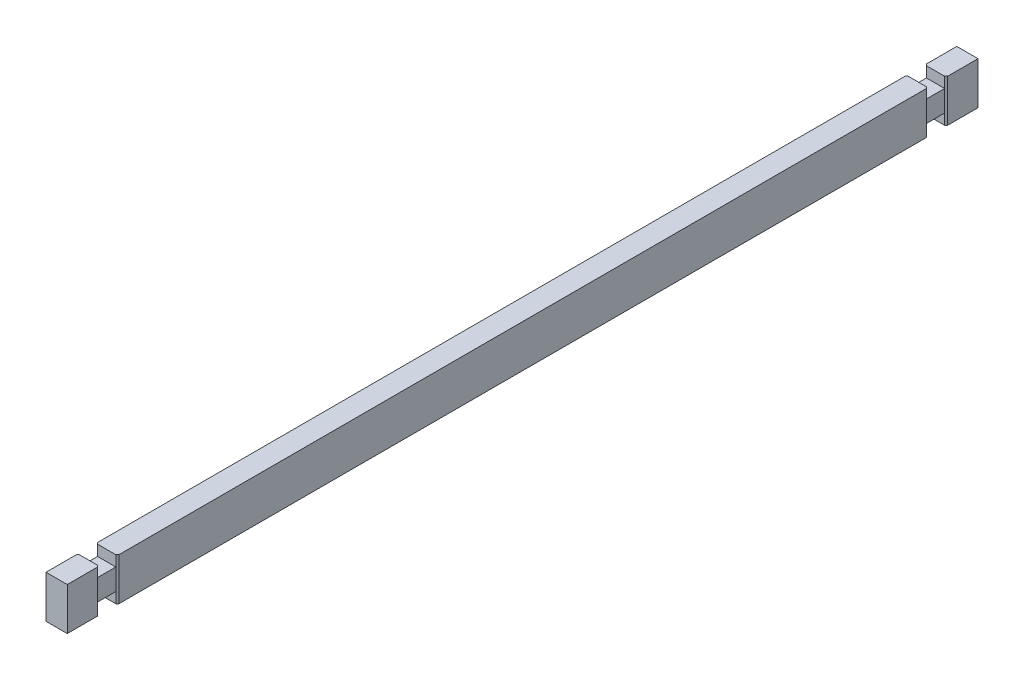
ISO-10303-21;
HEADER;
FILE_DESCRIPTION(('STEP AP214'),'2;1');
FILE_NAME('part.step','',(''),(''),'','','');
FILE_SCHEMA(('AUTOMOTIVE_DESIGN { 1 0 10303 214 1 1 1 1 }'));
ENDSEC;
DATA;
#1=APPLICATION_CONTEXT('core data for automotive mechanical design processes');
#2=APPLICATION_PROTOCOL_DEFINITION('international standard','automotive_design',2000,#1);
#3=PRODUCT_CONTEXT('',#1,'mechanical');
#4=PRODUCT('Part','Part','',(#3));
#5=PRODUCT_RELATED_PRODUCT_CATEGORY('part','',(#4));
#6=PRODUCT_DEFINITION_FORMATION('','',#4);
#7=PRODUCT_DEFINITION_CONTEXT('part definition',#1,'design');
#8=PRODUCT_DEFINITION('design','',#6,#7);
#9=PRODUCT_DEFINITION_SHAPE('','',#8);
#10=(LENGTH_UNIT() NAMED_UNIT(*) SI_UNIT(.MILLI.,.METRE.));
#11=(NAMED_UNIT(*) PLANE_ANGLE_UNIT() SI_UNIT($,.RADIAN.));
#12=(NAMED_UNIT(*) SI_UNIT($,.STERADIAN.) SOLID_ANGLE_UNIT());
#13=UNCERTAINTY_MEASURE_WITH_UNIT(LENGTH_MEASURE(1.E-05),#10,'distance_accuracy_value','');
#14=(GEOMETRIC_REPRESENTATION_CONTEXT(3) GLOBAL_UNCERTAINTY_ASSIGNED_CONTEXT((#13)) GLOBAL_UNIT_ASSIGNED_CONTEXT((#10,
#11,#12)) REPRESENTATION_CONTEXT('',''));
#15=CARTESIAN_POINT('',(0.,0.,0.));
#16=DIRECTION('',(0.,0.,1.));
#17=DIRECTION('',(1.,0.,0.));
#18=AXIS2_PLACEMENT_3D('',#15,#16,#17);
#19=CARTESIAN_POINT('',(-35.,-70.,3000.));
#20=DIRECTION('',(0.,1.,0.));
#21=DIRECTION('',(0.,0.,1.));
#22=AXIS2_PLACEMENT_3D('',#19,#20,#21);
#23=PLANE('',#22);
#24=DIRECTION('',(0.707106916720686,0.,-0.707106645652383));
#25=VECTOR('',#24,1.);
#26=CARTESIAN_POINT('',(-30.,-70.,2895.00000191674));
#27=LINE('',#26,#25);
#28=CARTESIAN_POINT('',(-35.,-70.,2900.));
#29=VERTEX_POINT('',#28);
#30=CARTESIAN_POINT('',(-30.,-70.,2895.00000191674));
#31=VERTEX_POINT('',#30);
#32=EDGE_CURVE('E48',#29,#31,#27,.T.);
#33=ORIENTED_EDGE('',*,*,#32,.T.);
#34=DIRECTION('',(1.,0.,0.));
#35=VECTOR('',#34,1.);
#36=CARTESIAN_POINT('',(-35.,-70.,2894.99999808326));
#37=LINE('',#36,#35);
#38=CARTESIAN_POINT('',(30.0000000000008,-70.,2894.99999808326));
#39=VERTEX_POINT('',#38);
#40=EDGE_CURVE('E215',#31,#39,#37,.T.);
#41=ORIENTED_EDGE('',*,*,#40,.T.);
#42=DIRECTION('',(0.707106645652409,0.,0.70710691672066));
#43=VECTOR('',#42,1.);
#44=CARTESIAN_POINT('',(35.,-70.,2900.));
#45=LINE('',#44,#43);
#46=CARTESIAN_POINT('',(35.,-70.,2900.));
#47=VERTEX_POINT('',#46);
#48=EDGE_CURVE('E227',#39,#47,#45,.T.);
#49=ORIENTED_EDGE('',*,*,#48,.T.);
#50=DIRECTION('',(0.,0.,-1.));
#51=VECTOR('',#50,1.);
#52=CARTESIAN_POINT('',(35.,-70.,3000.));
#53=LINE('',#52,#51);
#54=CARTESIAN_POINT('',(35.,-70.,3000.));
#55=VERTEX_POINT('',#54);
#56=EDGE_CURVE('E373',#55,#47,#53,.T.);
#57=ORIENTED_EDGE('',*,*,#56,.F.);
#58=DIRECTION('',(1.,0.,0.));
#59=VECTOR('',#58,1.);
#60=CARTESIAN_POINT('',(-35.,-70.,3000.));
#61=LINE('',#60,#59);
#62=CARTESIAN_POINT('',(-35.,-70.,3000.));
#63=VERTEX_POINT('',#62);
#64=EDGE_CURVE('E356',#63,#55,#61,.T.);
#65=ORIENTED_EDGE('',*,*,#64,.F.);
#66=DIRECTION('',(0.,0.,-1.));
#67=VECTOR('',#66,1.);
#68=CARTESIAN_POINT('',(-35.,-70.,3000.));
#69=LINE('',#68,#67);
#70=EDGE_CURVE('E377',#63,#29,#69,.T.);
#71=ORIENTED_EDGE('',*,*,#70,.T.);
#72=EDGE_LOOP('',(#33,#41,#49,#57,#65,#71));
#73=FACE_BOUND('',#72,.T.);
#74=ADVANCED_FACE('F26',(#73),#23,.F.);
#75=CARTESIAN_POINT('',(-35.,70.,3000.));
#76=DIRECTION('',(0.,-1.,0.));
#77=DIRECTION('',(0.,0.,-1.));
#78=AXIS2_PLACEMENT_3D('',#75,#76,#77);
#79=PLANE('',#78);
#80=DIRECTION('',(0.707106645652409,0.,0.70710691672066));
#81=VECTOR('',#80,1.);
#82=CARTESIAN_POINT('',(35.,70.,2900.));
#83=LINE('',#82,#81);
#84=CARTESIAN_POINT('',(30.0000000000008,70.,2894.99999808326));
#85=VERTEX_POINT('',#84);
#86=CARTESIAN_POINT('',(35.,70.,2900.));
#87=VERTEX_POINT('',#86);
#88=EDGE_CURVE('E241',#85,#87,#83,.T.);
#89=ORIENTED_EDGE('',*,*,#88,.F.);
#90=DIRECTION('',(1.,0.,0.));
#91=VECTOR('',#90,1.);
#92=CARTESIAN_POINT('',(-35.,70.,2894.99999808326));
#93=LINE('',#92,#91);
#94=CARTESIAN_POINT('',(-29.9999961665143,70.,2894.99999808326));
#95=VERTEX_POINT('',#94);
#96=EDGE_CURVE('E430',#95,#85,#93,.T.);
#97=ORIENTED_EDGE('',*,*,#96,.F.);
#98=DIRECTION('',(0.707106916720686,0.,-0.707106645652383));
#99=VECTOR('',#98,1.);
#100=CARTESIAN_POINT('',(-30.,70.,2895.00000191674));
#101=LINE('',#100,#99);
#102=CARTESIAN_POINT('',(-35.,70.,2900.));
#103=VERTEX_POINT('',#102);
#104=EDGE_CURVE('E398',#103,#95,#101,.T.);
#105=ORIENTED_EDGE('',*,*,#104,.F.);
#106=DIRECTION('',(0.,0.,-1.));
#107=VECTOR('',#106,1.);
#108=CARTESIAN_POINT('',(-35.,70.,3000.));
#109=LINE('',#108,#107);
#110=CARTESIAN_POINT('',(-35.,70.,3000.));
#111=VERTEX_POINT('',#110);
#112=EDGE_CURVE('E363',#111,#103,#109,.T.);
#113=ORIENTED_EDGE('',*,*,#112,.F.);
#114=DIRECTION('',(-1.,0.,0.));
#115=VECTOR('',#114,1.);
#116=CARTESIAN_POINT('',(-35.,70.,3000.));
#117=LINE('',#116,#115);
#118=CARTESIAN_POINT('',(35.,70.,3000.));
#119=VERTEX_POINT('',#118);
#120=EDGE_CURVE('E360',#119,#111,#117,.T.);
#121=ORIENTED_EDGE('',*,*,#120,.F.);
#122=DIRECTION('',(0.,0.,-1.));
#123=VECTOR('',#122,1.);
#124=CARTESIAN_POINT('',(35.,70.,3000.));
#125=LINE('',#124,#123);
#126=EDGE_CURVE('E368',#119,#87,#125,.T.);
#127=ORIENTED_EDGE('',*,*,#126,.T.);
#128=EDGE_LOOP('',(#89,#97,#105,#113,#121,#127));
#129=FACE_BOUND('',#128,.T.);
#130=ADVANCED_FACE('F459',(#129),#79,.F.);
#131=CARTESIAN_POINT('',(-35.,70.,3000.));
#132=DIRECTION('',(1.,0.,0.));
#133=DIRECTION('',(0.,1.,0.));
#134=AXIS2_PLACEMENT_3D('',#131,#132,#133);
#135=PLANE('',#134);
#136=CARTESIAN_POINT('',(-35.,-70.,2830.));
#137=VERTEX_POINT('',#136);
#138=CARTESIAN_POINT('',(-35.,-70.,170.));
#139=VERTEX_POINT('',#138);
#140=EDGE_CURVE('E378',#137,#139,#69,.T.);
#141=ORIENTED_EDGE('',*,*,#140,.F.);
#142=DIRECTION('',(0.,1.,0.));
#143=VECTOR('',#142,1.);
#144=CARTESIAN_POINT('',(-35.,-70.,2830.));
#145=LINE('',#144,#143);
#146=CARTESIAN_POINT('',(-35.,70.,2830.));
#147=VERTEX_POINT('',#146);
#148=EDGE_CURVE('E414',#137,#147,#145,.T.);
#149=ORIENTED_EDGE('',*,*,#148,.T.);
#150=CARTESIAN_POINT('',(-35.,70.,170.));
#151=VERTEX_POINT('',#150);
#152=EDGE_CURVE('E367',#147,#151,#109,.T.);
#153=ORIENTED_EDGE('',*,*,#152,.T.);
#154=DIRECTION('',(0.,1.,0.));
#155=VECTOR('',#154,1.);
#156=CARTESIAN_POINT('',(-35.,-70.,170.));
#157=LINE('',#156,#155);
#158=EDGE_CURVE('E328',#139,#151,#157,.T.);
#159=ORIENTED_EDGE('',*,*,#158,.F.);
#160=EDGE_LOOP('',(#141,#149,#153,#159));
#161=FACE_BOUND('',#160,.T.);
#162=ADVANCED_FACE('F474',(#161),#135,.F.);
#163=CARTESIAN_POINT('',(35.,70.,3000.));
#164=DIRECTION('',(-1.,0.,0.));
#165=DIRECTION('',(0.,-1.,0.));
#166=AXIS2_PLACEMENT_3D('',#163,#164,#165);
#167=PLANE('',#166);
#168=CARTESIAN_POINT('',(35.,70.,2830.));
#169=VERTEX_POINT('',#168);
#170=CARTESIAN_POINT('',(35.,70.,170.));
#171=VERTEX_POINT('',#170);
#172=EDGE_CURVE('E372',#169,#171,#125,.T.);
#173=ORIENTED_EDGE('',*,*,#172,.F.);
#174=DIRECTION('',(0.,1.,0.));
#175=VECTOR('',#174,1.);
#176=CARTESIAN_POINT('',(35.,-70.,2830.));
#177=LINE('',#176,#175);
#178=CARTESIAN_POINT('',(35.,-70.,2830.));
#179=VERTEX_POINT('',#178);
#180=EDGE_CURVE('E245',#179,#169,#177,.T.);
#181=ORIENTED_EDGE('',*,*,#180,.F.);
#182=CARTESIAN_POINT('',(35.,-70.,170.));
#183=VERTEX_POINT('',#182);
#184=EDGE_CURVE('E376',#179,#183,#53,.T.);
#185=ORIENTED_EDGE('',*,*,#184,.T.);
#186=DIRECTION('',(0.,1.,0.));
#187=VECTOR('',#186,1.);
#188=CARTESIAN_POINT('',(35.,-70.,170.));
#189=LINE('',#188,#187);
#190=EDGE_CURVE('E305',#183,#171,#189,.T.);
#191=ORIENTED_EDGE('',*,*,#190,.T.);
#192=EDGE_LOOP('',(#173,#181,#185,#191));
#193=FACE_BOUND('',#192,.T.);
#194=ADVANCED_FACE('F486',(#193),#167,.F.);
#195=DIRECTION('',(-0.707106916720707,0.,0.707106645652362));
#196=VECTOR('',#195,1.);
#197=CARTESIAN_POINT('',(30.0000000000001,-70.,2834.99999808326));
#198=LINE('',#197,#196);
#199=CARTESIAN_POINT('',(30.0000000000008,-70.,2834.99999808326));
#200=VERTEX_POINT('',#199);
#201=EDGE_CURVE('E236',#179,#200,#198,.T.);
#202=ORIENTED_EDGE('',*,*,#201,.T.);
#203=DIRECTION('',(1.,0.,0.));
#204=VECTOR('',#203,1.);
#205=CARTESIAN_POINT('',(-35.,-70.,2834.99999808326));
#206=LINE('',#205,#204);
#207=CARTESIAN_POINT('',(-30.,-70.,2834.99999808326));
#208=VERTEX_POINT('',#207);
#209=EDGE_CURVE('E230',#208,#200,#206,.T.);
#210=ORIENTED_EDGE('',*,*,#209,.F.);
#211=DIRECTION('',(-0.70710664565245,0.,-0.707106916720619));
#212=VECTOR('',#211,1.);
#213=CARTESIAN_POINT('',(-35.,-70.,2830.));
#214=LINE('',#213,#212);
#215=EDGE_CURVE('E404',#208,#137,#214,.T.);
#216=ORIENTED_EDGE('',*,*,#215,.T.);
#217=ORIENTED_EDGE('',*,*,#140,.T.);
#218=DIRECTION('',(0.707106781186543,0.,-0.707106781186552));
#219=VECTOR('',#218,1.);
#220=CARTESIAN_POINT('',(-30.,-70.,165.));
#221=LINE('',#220,#219);
#222=CARTESIAN_POINT('',(-30.,-70.,165.));
#223=VERTEX_POINT('',#222);
#224=EDGE_CURVE('E322',#139,#223,#221,.T.);
#225=ORIENTED_EDGE('',*,*,#224,.T.);
#226=DIRECTION('',(1.,0.,0.));
#227=VECTOR('',#226,1.);
#228=CARTESIAN_POINT('',(-35.,-70.,165.));
#229=LINE('',#228,#227);
#230=CARTESIAN_POINT('',(30.,-70.,165.));
#231=VERTEX_POINT('',#230);
#232=EDGE_CURVE('E252',#223,#231,#229,.T.);
#233=ORIENTED_EDGE('',*,*,#232,.T.);
#234=DIRECTION('',(0.707106781186545,0.,0.70710678118655));
#235=VECTOR('',#234,1.);
#236=CARTESIAN_POINT('',(30.,-70.,165.));
#237=LINE('',#236,#235);
#238=EDGE_CURVE('E301',#231,#183,#237,.T.);
#239=ORIENTED_EDGE('',*,*,#238,.T.);
#240=ORIENTED_EDGE('',*,*,#184,.F.);
#241=EDGE_LOOP('',(#202,#210,#216,#217,#225,#233,#239,#240));
#242=FACE_BOUND('',#241,.T.);
#243=ADVANCED_FACE('F482',(#242),#23,.F.);
#244=DIRECTION('',(-0.70710664565245,0.,-0.707106916720619));
#245=VECTOR('',#244,1.);
#246=CARTESIAN_POINT('',(-35.,70.,2830.));
#247=LINE('',#246,#245);
#248=CARTESIAN_POINT('',(-30.,70.,2834.99999808326));
#249=VERTEX_POINT('',#248);
#250=EDGE_CURVE('E427',#249,#147,#247,.T.);
#251=ORIENTED_EDGE('',*,*,#250,.F.);
#252=DIRECTION('',(1.,0.,0.));
#253=VECTOR('',#252,1.);
#254=CARTESIAN_POINT('',(-35.,70.,2834.99999808326));
#255=LINE('',#254,#253);
#256=CARTESIAN_POINT('',(30.0000000000008,70.,2834.99999808326));
#257=VERTEX_POINT('',#256);
#258=EDGE_CURVE('E434',#249,#257,#255,.T.);
#259=ORIENTED_EDGE('',*,*,#258,.T.);
#260=DIRECTION('',(-0.707106916720707,0.,0.707106645652362));
#261=VECTOR('',#260,1.);
#262=CARTESIAN_POINT('',(30.0000000000001,70.,2834.99999808326));
#263=LINE('',#262,#261);
#264=EDGE_CURVE('E417',#169,#257,#263,.T.);
#265=ORIENTED_EDGE('',*,*,#264,.F.);
#266=ORIENTED_EDGE('',*,*,#172,.T.);
#267=DIRECTION('',(0.707106781186545,0.,0.70710678118655));
#268=VECTOR('',#267,1.);
#269=CARTESIAN_POINT('',(30.,70.,165.));
#270=LINE('',#269,#268);
#271=CARTESIAN_POINT('',(30.,70.,165.));
#272=VERTEX_POINT('',#271);
#273=EDGE_CURVE('E295',#272,#171,#270,.T.);
#274=ORIENTED_EDGE('',*,*,#273,.F.);
#275=DIRECTION('',(1.,0.,0.));
#276=VECTOR('',#275,1.);
#277=CARTESIAN_POINT('',(-35.,70.,165.));
#278=LINE('',#277,#276);
#279=CARTESIAN_POINT('',(-30.,70.,165.));
#280=VERTEX_POINT('',#279);
#281=EDGE_CURVE('E273',#280,#272,#278,.T.);
#282=ORIENTED_EDGE('',*,*,#281,.F.);
#283=DIRECTION('',(0.707106781186543,0.,-0.707106781186552));
#284=VECTOR('',#283,1.);
#285=CARTESIAN_POINT('',(-30.,70.,165.));
#286=LINE('',#285,#284);
#287=EDGE_CURVE('E308',#151,#280,#286,.T.);
#288=ORIENTED_EDGE('',*,*,#287,.F.);
#289=ORIENTED_EDGE('',*,*,#152,.F.);
#290=EDGE_LOOP('',(#251,#259,#265,#266,#274,#282,#288,#289));
#291=FACE_BOUND('',#290,.T.);
#292=ADVANCED_FACE('F491',(#291),#79,.F.);
#293=ORIENTED_EDGE('',*,*,#56,.T.);
#294=DIRECTION('',(0.,1.,0.));
#295=VECTOR('',#294,1.);
#296=CARTESIAN_POINT('',(35.,-70.,2900.));
#297=LINE('',#296,#295);
#298=EDGE_CURVE('E221',#47,#87,#297,.T.);
#299=ORIENTED_EDGE('',*,*,#298,.T.);
#300=ORIENTED_EDGE('',*,*,#126,.F.);
#301=DIRECTION('',(0.,1.,0.));
#302=VECTOR('',#301,1.);
#303=CARTESIAN_POINT('',(35.,70.,3000.));
#304=LINE('',#303,#302);
#305=EDGE_CURVE('E358',#55,#119,#304,.T.);
#306=ORIENTED_EDGE('',*,*,#305,.F.);
#307=EDGE_LOOP('',(#293,#299,#300,#306));
#308=FACE_BOUND('',#307,.T.);
#309=ADVANCED_FACE('F465',(#308),#167,.F.);
#310=CARTESIAN_POINT('',(-35.,-70.,100.));
#311=VERTEX_POINT('',#310);
#312=CARTESIAN_POINT('',(-35.,-70.,0.));
#313=VERTEX_POINT('',#312);
#314=EDGE_CURVE('E375',#311,#313,#69,.T.);
#315=ORIENTED_EDGE('',*,*,#314,.F.);
#316=DIRECTION('',(0.,1.,0.));
#317=VECTOR('',#316,1.);
#318=CARTESIAN_POINT('',(-35.,-70.,100.));
#319=LINE('',#318,#317);
#320=CARTESIAN_POINT('',(-35.,70.,100.));
#321=VERTEX_POINT('',#320);
#322=EDGE_CURVE('E329',#311,#321,#319,.T.);
#323=ORIENTED_EDGE('',*,*,#322,.T.);
#324=CARTESIAN_POINT('',(-35.,70.,0.));
#325=VERTEX_POINT('',#324);
#326=EDGE_CURVE('E362',#321,#325,#109,.T.);
#327=ORIENTED_EDGE('',*,*,#326,.T.);
#328=DIRECTION('',(0.,-1.,0.));
#329=VECTOR('',#328,1.);
#330=CARTESIAN_POINT('',(-35.,70.,0.));
#331=LINE('',#330,#329);
#332=EDGE_CURVE('E332',#325,#313,#331,.T.);
#333=ORIENTED_EDGE('',*,*,#332,.T.);
#334=EDGE_LOOP('',(#315,#323,#327,#333));
#335=FACE_BOUND('',#334,.T.);
#336=ADVANCED_FACE('F473',(#335),#135,.F.);
#337=ORIENTED_EDGE('',*,*,#112,.T.);
#338=DIRECTION('',(0.,1.,0.));
#339=VECTOR('',#338,1.);
#340=CARTESIAN_POINT('',(-35.,-70.,2900.));
#341=LINE('',#340,#339);
#342=EDGE_CURVE('E401',#29,#103,#341,.T.);
#343=ORIENTED_EDGE('',*,*,#342,.F.);
#344=ORIENTED_EDGE('',*,*,#70,.F.);
#345=DIRECTION('',(0.,-1.,0.));
#346=VECTOR('',#345,1.);
#347=CARTESIAN_POINT('',(-35.,70.,3000.));
#348=LINE('',#347,#346);
#349=EDGE_CURVE('E353',#111,#63,#348,.T.);
#350=ORIENTED_EDGE('',*,*,#349,.F.);
#351=EDGE_LOOP('',(#337,#343,#344,#350));
#352=FACE_BOUND('',#351,.T.);
#353=ADVANCED_FACE('F28',(#352),#135,.F.);
#354=DIRECTION('',(-0.70710678118655,0.,0.707106781186545));
#355=VECTOR('',#354,1.);
#356=CARTESIAN_POINT('',(35.,-70.,100.));
#357=LINE('',#356,#355);
#358=CARTESIAN_POINT('',(35.,-70.,100.));
#359=VERTEX_POINT('',#358);
#360=CARTESIAN_POINT('',(30.,-70.,105.));
#361=VERTEX_POINT('',#360);
#362=EDGE_CURVE('E298',#359,#361,#357,.T.);
#363=ORIENTED_EDGE('',*,*,#362,.T.);
#364=DIRECTION('',(1.,0.,0.));
#365=VECTOR('',#364,1.);
#366=CARTESIAN_POINT('',(-35.,-70.,105.));
#367=LINE('',#366,#365);
#368=CARTESIAN_POINT('',(-30.,-70.,105.));
#369=VERTEX_POINT('',#368);
#370=EDGE_CURVE('E258',#369,#361,#367,.T.);
#371=ORIENTED_EDGE('',*,*,#370,.F.);
#372=DIRECTION('',(-0.707106781186551,0.,-0.707106781186544));
#373=VECTOR('',#372,1.);
#374=CARTESIAN_POINT('',(-35.,-70.,100.));
#375=LINE('',#374,#373);
#376=EDGE_CURVE('E325',#369,#311,#375,.T.);
#377=ORIENTED_EDGE('',*,*,#376,.T.);
#378=ORIENTED_EDGE('',*,*,#314,.T.);
#379=DIRECTION('',(1.,0.,0.));
#380=VECTOR('',#379,1.);
#381=CARTESIAN_POINT('',(-35.,-70.,0.));
#382=LINE('',#381,#380);
#383=CARTESIAN_POINT('',(35.,-70.,0.));
#384=VERTEX_POINT('',#383);
#385=EDGE_CURVE('E344',#313,#384,#382,.T.);
#386=ORIENTED_EDGE('',*,*,#385,.T.);
#387=EDGE_CURVE('E371',#359,#384,#53,.T.);
#388=ORIENTED_EDGE('',*,*,#387,.F.);
#389=EDGE_LOOP('',(#363,#371,#377,#378,#386,#388));
#390=FACE_BOUND('',#389,.T.);
#391=ADVANCED_FACE('F472',(#390),#23,.F.);
#392=CARTESIAN_POINT('',(35.,70.,100.000000000001));
#393=VERTEX_POINT('',#392);
#394=CARTESIAN_POINT('',(35.,70.,0.));
#395=VERTEX_POINT('',#394);
#396=EDGE_CURVE('E366',#393,#395,#125,.T.);
#397=ORIENTED_EDGE('',*,*,#396,.F.);
#398=DIRECTION('',(0.,1.,0.));
#399=VECTOR('',#398,1.);
#400=CARTESIAN_POINT('',(35.,-70.,100.));
#401=LINE('',#400,#399);
#402=EDGE_CURVE('E304',#359,#393,#401,.T.);
#403=ORIENTED_EDGE('',*,*,#402,.F.);
#404=ORIENTED_EDGE('',*,*,#387,.T.);
#405=DIRECTION('',(0.,1.,0.));
#406=VECTOR('',#405,1.);
#407=CARTESIAN_POINT('',(35.,70.,0.));
#408=LINE('',#407,#406);
#409=EDGE_CURVE('E347',#384,#395,#408,.T.);
#410=ORIENTED_EDGE('',*,*,#409,.T.);
#411=EDGE_LOOP('',(#397,#403,#404,#410));
#412=FACE_BOUND('',#411,.T.);
#413=ADVANCED_FACE('F480',(#412),#167,.F.);
#414=DIRECTION('',(-0.707106781186551,0.,-0.707106781186544));
#415=VECTOR('',#414,1.);
#416=CARTESIAN_POINT('',(-35.,70.,100.));
#417=LINE('',#416,#415);
#418=CARTESIAN_POINT('',(-30.,70.,105.));
#419=VERTEX_POINT('',#418);
#420=EDGE_CURVE('E320',#419,#321,#417,.T.);
#421=ORIENTED_EDGE('',*,*,#420,.F.);
#422=DIRECTION('',(1.,0.,0.));
#423=VECTOR('',#422,1.);
#424=CARTESIAN_POINT('',(-35.,70.,105.));
#425=LINE('',#424,#423);
#426=CARTESIAN_POINT('',(30.,70.,105.));
#427=VERTEX_POINT('',#426);
#428=EDGE_CURVE('E276',#419,#427,#425,.T.);
#429=ORIENTED_EDGE('',*,*,#428,.T.);
#430=DIRECTION('',(-0.70710678118655,0.,0.707106781186545));
#431=VECTOR('',#430,1.);
#432=CARTESIAN_POINT('',(35.,70.,100.));
#433=LINE('',#432,#431);
#434=EDGE_CURVE('E292',#393,#427,#433,.T.);
#435=ORIENTED_EDGE('',*,*,#434,.F.);
#436=ORIENTED_EDGE('',*,*,#396,.T.);
#437=DIRECTION('',(-1.,0.,0.));
#438=VECTOR('',#437,1.);
#439=CARTESIAN_POINT('',(-35.,70.,0.));
#440=LINE('',#439,#438);
#441=EDGE_CURVE('E350',#395,#325,#440,.T.);
#442=ORIENTED_EDGE('',*,*,#441,.T.);
#443=ORIENTED_EDGE('',*,*,#326,.F.);
#444=EDGE_LOOP('',(#421,#429,#435,#436,#442,#443));
#445=FACE_BOUND('',#444,.T.);
#446=ADVANCED_FACE('F492',(#445),#79,.F.);
#447=CARTESIAN_POINT('',(-35.,-70.,3000.));
#448=DIRECTION('',(0.,0.,1.));
#449=DIRECTION('',(1.,0.,0.));
#450=AXIS2_PLACEMENT_3D('',#447,#448,#449);
#451=PLANE('',#450);
#452=ORIENTED_EDGE('',*,*,#349,.T.);
#453=ORIENTED_EDGE('',*,*,#64,.T.);
#454=ORIENTED_EDGE('',*,*,#305,.T.);
#455=ORIENTED_EDGE('',*,*,#120,.T.);
#456=EDGE_LOOP('',(#452,#453,#454,#455));
#457=FACE_BOUND('',#456,.T.);
#458=ADVANCED_FACE('F469',(#457),#451,.T.);
#459=CARTESIAN_POINT('',(-35.,-70.,0.));
#460=DIRECTION('',(0.,0.,1.));
#461=DIRECTION('',(1.,0.,0.));
#462=AXIS2_PLACEMENT_3D('',#459,#460,#461);
#463=PLANE('',#462);
#464=ORIENTED_EDGE('',*,*,#332,.F.);
#465=ORIENTED_EDGE('',*,*,#441,.F.);
#466=ORIENTED_EDGE('',*,*,#409,.F.);
#467=ORIENTED_EDGE('',*,*,#385,.F.);
#468=EDGE_LOOP('',(#464,#465,#466,#467));
#469=FACE_BOUND('',#468,.T.);
#470=ADVANCED_FACE('F525',(#469),#463,.F.);
#471=CARTESIAN_POINT('',(-35.,-70.,100.));
#472=DIRECTION('',(0.707106781186544,0.,-0.707106781186551));
#473=DIRECTION('',(-0.707106781186551,0.,-0.707106781186544));
#474=AXIS2_PLACEMENT_3D('',#471,#472,#473);
#475=PLANE('',#474);
#476=ORIENTED_EDGE('',*,*,#420,.T.);
#477=ORIENTED_EDGE('',*,*,#322,.F.);
#478=ORIENTED_EDGE('',*,*,#376,.F.);
#479=DIRECTION('',(0.,1.,0.));
#480=VECTOR('',#479,1.);
#481=CARTESIAN_POINT('',(-30.,-70.,105.));
#482=LINE('',#481,#480);
#483=CARTESIAN_POINT('',(-30.,-35.,105.));
#484=VERTEX_POINT('',#483);
#485=EDGE_CURVE('E333',#369,#484,#482,.T.);
#486=ORIENTED_EDGE('',*,*,#485,.T.);
#487=CARTESIAN_POINT('',(-30.,35.,105.));
#488=VERTEX_POINT('',#487);
#489=EDGE_CURVE('E336',#484,#488,#482,.T.);
#490=ORIENTED_EDGE('',*,*,#489,.T.);
#491=DIRECTION('',(0.,1.,0.));
#492=VECTOR('',#491,1.);
#493=CARTESIAN_POINT('',(-30.,-70.,105.));
#494=LINE('',#493,#492);
#495=EDGE_CURVE('E275',#488,#419,#494,.T.);
#496=ORIENTED_EDGE('',*,*,#495,.T.);
#497=EDGE_LOOP('',(#476,#477,#478,#486,#490,#496));
#498=FACE_BOUND('',#497,.T.);
#499=ADVANCED_FACE('F570',(#498),#475,.F.);
#500=CARTESIAN_POINT('',(-30.,-70.,165.));
#501=DIRECTION('',(1.,0.,0.));
#502=DIRECTION('',(0.,0.,-1.));
#503=AXIS2_PLACEMENT_3D('',#500,#501,#502);
#504=PLANE('',#503);
#505=ORIENTED_EDGE('',*,*,#489,.F.);
#506=DIRECTION('',(0.,0.,1.));
#507=VECTOR('',#506,1.);
#508=CARTESIAN_POINT('',(-30.,-35.,165.));
#509=LINE('',#508,#507);
#510=CARTESIAN_POINT('',(-30.,-35.,165.));
#511=VERTEX_POINT('',#510);
#512=EDGE_CURVE('E255',#484,#511,#509,.T.);
#513=ORIENTED_EDGE('',*,*,#512,.T.);
#514=DIRECTION('',(0.,1.,0.));
#515=VECTOR('',#514,1.);
#516=CARTESIAN_POINT('',(-30.,-70.,165.));
#517=LINE('',#516,#515);
#518=CARTESIAN_POINT('',(-30.,35.,165.));
#519=VERTEX_POINT('',#518);
#520=EDGE_CURVE('E339',#511,#519,#517,.T.);
#521=ORIENTED_EDGE('',*,*,#520,.T.);
#522=DIRECTION('',(0.,0.,-1.));
#523=VECTOR('',#522,1.);
#524=CARTESIAN_POINT('',(-30.,35.,165.));
#525=LINE('',#524,#523);
#526=EDGE_CURVE('E286',#519,#488,#525,.T.);
#527=ORIENTED_EDGE('',*,*,#526,.T.);
#528=EDGE_LOOP('',(#505,#513,#521,#527));
#529=FACE_BOUND('',#528,.T.);
#530=ADVANCED_FACE('F552',(#529),#504,.F.);
#531=CARTESIAN_POINT('',(-30.,-70.,165.));
#532=DIRECTION('',(0.707106781186552,0.,0.707106781186543));
#533=DIRECTION('',(0.707106781186543,0.,-0.707106781186552));
#534=AXIS2_PLACEMENT_3D('',#531,#532,#533);
#535=PLANE('',#534);
#536=ORIENTED_EDGE('',*,*,#287,.T.);
#537=DIRECTION('',(0.,-1.,0.));
#538=VECTOR('',#537,1.);
#539=CARTESIAN_POINT('',(-30.,-70.,165.));
#540=LINE('',#539,#538);
#541=EDGE_CURVE('E289',#280,#519,#540,.T.);
#542=ORIENTED_EDGE('',*,*,#541,.T.);
#543=ORIENTED_EDGE('',*,*,#520,.F.);
#544=EDGE_CURVE('E337',#223,#511,#517,.T.);
#545=ORIENTED_EDGE('',*,*,#544,.F.);
#546=ORIENTED_EDGE('',*,*,#224,.F.);
#547=ORIENTED_EDGE('',*,*,#158,.T.);
#548=EDGE_LOOP('',(#536,#542,#543,#545,#546,#547));
#549=FACE_BOUND('',#548,.T.);
#550=ADVANCED_FACE('F531',(#549),#535,.F.);
#551=CARTESIAN_POINT('',(30.,-70.,165.));
#552=DIRECTION('',(-0.70710678118655,0.,0.707106781186545));
#553=DIRECTION('',(0.707106781186545,0.,0.70710678118655));
#554=AXIS2_PLACEMENT_3D('',#551,#552,#553);
#555=PLANE('',#554);
#556=ORIENTED_EDGE('',*,*,#273,.T.);
#557=ORIENTED_EDGE('',*,*,#190,.F.);
#558=ORIENTED_EDGE('',*,*,#238,.F.);
#559=DIRECTION('',(0.,1.,0.));
#560=VECTOR('',#559,1.);
#561=CARTESIAN_POINT('',(30.,-70.,165.));
#562=LINE('',#561,#560);
#563=CARTESIAN_POINT('',(30.,-35.,165.));
#564=VERTEX_POINT('',#563);
#565=EDGE_CURVE('E309',#231,#564,#562,.T.);
#566=ORIENTED_EDGE('',*,*,#565,.T.);
#567=CARTESIAN_POINT('',(30.,35.,165.));
#568=VERTEX_POINT('',#567);
#569=EDGE_CURVE('E312',#564,#568,#562,.T.);
#570=ORIENTED_EDGE('',*,*,#569,.T.);
#571=DIRECTION('',(0.,-1.,0.));
#572=VECTOR('',#571,1.);
#573=CARTESIAN_POINT('',(30.,70.,165.));
#574=LINE('',#573,#572);
#575=EDGE_CURVE('E264',#272,#568,#574,.T.);
#576=ORIENTED_EDGE('',*,*,#575,.F.);
#577=EDGE_LOOP('',(#556,#557,#558,#566,#570,#576));
#578=FACE_BOUND('',#577,.T.);
#579=ADVANCED_FACE('F540',(#578),#555,.F.);
#580=CARTESIAN_POINT('',(30.,-70.,105.));
#581=DIRECTION('',(-1.,0.,0.));
#582=DIRECTION('',(0.,0.,1.));
#583=AXIS2_PLACEMENT_3D('',#580,#581,#582);
#584=PLANE('',#583);
#585=ORIENTED_EDGE('',*,*,#569,.F.);
#586=DIRECTION('',(0.,0.,1.));
#587=VECTOR('',#586,1.);
#588=CARTESIAN_POINT('',(30.,-35.,165.));
#589=LINE('',#588,#587);
#590=CARTESIAN_POINT('',(30.,-35.,105.));
#591=VERTEX_POINT('',#590);
#592=EDGE_CURVE('E247',#591,#564,#589,.T.);
#593=ORIENTED_EDGE('',*,*,#592,.F.);
#594=DIRECTION('',(0.,1.,0.));
#595=VECTOR('',#594,1.);
#596=CARTESIAN_POINT('',(30.,-70.,105.));
#597=LINE('',#596,#595);
#598=CARTESIAN_POINT('',(30.,35.,105.));
#599=VERTEX_POINT('',#598);
#600=EDGE_CURVE('E316',#591,#599,#597,.T.);
#601=ORIENTED_EDGE('',*,*,#600,.T.);
#602=DIRECTION('',(0.,0.,-1.));
#603=VECTOR('',#602,1.);
#604=CARTESIAN_POINT('',(30.,35.,165.));
#605=LINE('',#604,#603);
#606=EDGE_CURVE('E267',#568,#599,#605,.T.);
#607=ORIENTED_EDGE('',*,*,#606,.F.);
#608=EDGE_LOOP('',(#585,#593,#601,#607));
#609=FACE_BOUND('',#608,.T.);
#610=ADVANCED_FACE('F563',(#609),#584,.F.);
#611=CARTESIAN_POINT('',(35.,-70.,100.));
#612=DIRECTION('',(-0.707106781186545,0.,-0.70710678118655));
#613=DIRECTION('',(-0.70710678118655,0.,0.707106781186545));
#614=AXIS2_PLACEMENT_3D('',#611,#612,#613);
#615=PLANE('',#614);
#616=ORIENTED_EDGE('',*,*,#434,.T.);
#617=DIRECTION('',(0.,1.,0.));
#618=VECTOR('',#617,1.);
#619=CARTESIAN_POINT('',(30.,70.,105.));
#620=LINE('',#619,#618);
#621=EDGE_CURVE('E270',#599,#427,#620,.T.);
#622=ORIENTED_EDGE('',*,*,#621,.F.);
#623=ORIENTED_EDGE('',*,*,#600,.F.);
#624=EDGE_CURVE('E313',#361,#591,#597,.T.);
#625=ORIENTED_EDGE('',*,*,#624,.F.);
#626=ORIENTED_EDGE('',*,*,#362,.F.);
#627=ORIENTED_EDGE('',*,*,#402,.T.);
#628=EDGE_LOOP('',(#616,#622,#623,#625,#626,#627));
#629=FACE_BOUND('',#628,.T.);
#630=ADVANCED_FACE('F565',(#629),#615,.F.);
#631=CARTESIAN_POINT('',(-35.,70.,165.));
#632=DIRECTION('',(0.,0.,1.));
#633=DIRECTION('',(1.,0.,0.));
#634=AXIS2_PLACEMENT_3D('',#631,#632,#633);
#635=PLANE('',#634);
#636=ORIENTED_EDGE('',*,*,#281,.T.);
#637=ORIENTED_EDGE('',*,*,#575,.T.);
#638=DIRECTION('',(1.,0.,0.));
#639=VECTOR('',#638,1.);
#640=CARTESIAN_POINT('',(-35.,35.,165.));
#641=LINE('',#640,#639);
#642=EDGE_CURVE('E272',#519,#568,#641,.T.);
#643=ORIENTED_EDGE('',*,*,#642,.F.);
#644=ORIENTED_EDGE('',*,*,#541,.F.);
#645=EDGE_LOOP('',(#636,#637,#643,#644));
#646=FACE_BOUND('',#645,.T.);
#647=ADVANCED_FACE('F536',(#646),#635,.F.);
#648=CARTESIAN_POINT('',(-35.,35.,165.));
#649=DIRECTION('',(0.,-1.,0.));
#650=DIRECTION('',(0.,0.,-1.));
#651=AXIS2_PLACEMENT_3D('',#648,#649,#650);
#652=PLANE('',#651);
#653=ORIENTED_EDGE('',*,*,#642,.T.);
#654=ORIENTED_EDGE('',*,*,#606,.T.);
#655=DIRECTION('',(1.,0.,0.));
#656=VECTOR('',#655,1.);
#657=CARTESIAN_POINT('',(-35.,35.,105.));
#658=LINE('',#657,#656);
#659=EDGE_CURVE('E279',#488,#599,#658,.T.);
#660=ORIENTED_EDGE('',*,*,#659,.F.);
#661=ORIENTED_EDGE('',*,*,#526,.F.);
#662=EDGE_LOOP('',(#653,#654,#660,#661));
#663=FACE_BOUND('',#662,.T.);
#664=ADVANCED_FACE('F547',(#663),#652,.F.);
#665=CARTESIAN_POINT('',(-35.,70.,105.));
#666=DIRECTION('',(0.,0.,-1.));
#667=DIRECTION('',(-1.,0.,0.));
#668=AXIS2_PLACEMENT_3D('',#665,#666,#667);
#669=PLANE('',#668);
#670=ORIENTED_EDGE('',*,*,#659,.T.);
#671=ORIENTED_EDGE('',*,*,#621,.T.);
#672=ORIENTED_EDGE('',*,*,#428,.F.);
#673=ORIENTED_EDGE('',*,*,#495,.F.);
#674=EDGE_LOOP('',(#670,#671,#672,#673));
#675=FACE_BOUND('',#674,.T.);
#676=ADVANCED_FACE('F567',(#675),#669,.F.);
#677=CARTESIAN_POINT('',(-35.,-35.,165.));
#678=DIRECTION('',(0.,0.,1.));
#679=DIRECTION('',(1.,0.,0.));
#680=AXIS2_PLACEMENT_3D('',#677,#678,#679);
#681=PLANE('',#680);
#682=DIRECTION('',(1.,0.,0.));
#683=VECTOR('',#682,1.);
#684=CARTESIAN_POINT('',(-35.,-35.,165.));
#685=LINE('',#684,#683);
#686=EDGE_CURVE('E253',#511,#564,#685,.T.);
#687=ORIENTED_EDGE('',*,*,#686,.T.);
#688=ORIENTED_EDGE('',*,*,#565,.F.);
#689=ORIENTED_EDGE('',*,*,#232,.F.);
#690=ORIENTED_EDGE('',*,*,#544,.T.);
#691=EDGE_LOOP('',(#687,#688,#689,#690));
#692=FACE_BOUND('',#691,.T.);
#693=ADVANCED_FACE('F602',(#692),#681,.F.);
#694=CARTESIAN_POINT('',(-35.,-35.,165.));
#695=DIRECTION('',(0.,1.,0.));
#696=DIRECTION('',(0.,0.,1.));
#697=AXIS2_PLACEMENT_3D('',#694,#695,#696);
#698=PLANE('',#697);
#699=DIRECTION('',(1.,0.,0.));
#700=VECTOR('',#699,1.);
#701=CARTESIAN_POINT('',(-35.,-35.,105.));
#702=LINE('',#701,#700);
#703=EDGE_CURVE('E256',#484,#591,#702,.T.);
#704=ORIENTED_EDGE('',*,*,#703,.T.);
#705=ORIENTED_EDGE('',*,*,#592,.T.);
#706=ORIENTED_EDGE('',*,*,#686,.F.);
#707=ORIENTED_EDGE('',*,*,#512,.F.);
#708=EDGE_LOOP('',(#704,#705,#706,#707));
#709=FACE_BOUND('',#708,.T.);
#710=ADVANCED_FACE('F556',(#709),#698,.F.);
#711=CARTESIAN_POINT('',(-35.,-35.,105.));
#712=DIRECTION('',(0.,0.,-1.));
#713=DIRECTION('',(0.,1.,0.));
#714=AXIS2_PLACEMENT_3D('',#711,#712,#713);
#715=PLANE('',#714);
#716=ORIENTED_EDGE('',*,*,#370,.T.);
#717=ORIENTED_EDGE('',*,*,#624,.T.);
#718=ORIENTED_EDGE('',*,*,#703,.F.);
#719=ORIENTED_EDGE('',*,*,#485,.F.);
#720=EDGE_LOOP('',(#716,#717,#718,#719));
#721=FACE_BOUND('',#720,.T.);
#722=ADVANCED_FACE('F558',(#721),#715,.F.);
#723=CARTESIAN_POINT('',(30.0000000000001,-70.,2834.99999808326));
#724=DIRECTION('',(-0.707106645652362,0.,-0.707106916720707));
#725=DIRECTION('',(-0.707106916720707,0.,0.707106645652362));
#726=AXIS2_PLACEMENT_3D('',#723,#724,#725);
#727=PLANE('',#726);
#728=ORIENTED_EDGE('',*,*,#264,.T.);
#729=DIRECTION('',(0.,1.,0.));
#730=VECTOR('',#729,1.);
#731=CARTESIAN_POINT('',(30.0000000000008,70.,2834.99999808326));
#732=LINE('',#731,#730);
#733=CARTESIAN_POINT('',(30.0000000000008,35.,2834.99999808326));
#734=VERTEX_POINT('',#733);
#735=EDGE_CURVE('E432',#734,#257,#732,.T.);
#736=ORIENTED_EDGE('',*,*,#735,.F.);
#737=DIRECTION('',(0.,1.,0.));
#738=VECTOR('',#737,1.);
#739=CARTESIAN_POINT('',(30.0000000000001,-70.,2834.99999808326));
#740=LINE('',#739,#738);
#741=CARTESIAN_POINT('',(30.0000000000008,-35.,2834.99999808326));
#742=VERTEX_POINT('',#741);
#743=EDGE_CURVE('E235',#742,#734,#740,.T.);
#744=ORIENTED_EDGE('',*,*,#743,.F.);
#745=EDGE_CURVE('E238',#200,#742,#740,.T.);
#746=ORIENTED_EDGE('',*,*,#745,.F.);
#747=ORIENTED_EDGE('',*,*,#201,.F.);
#748=ORIENTED_EDGE('',*,*,#180,.T.);
#749=EDGE_LOOP('',(#728,#736,#744,#746,#747,#748));
#750=FACE_BOUND('',#749,.T.);
#751=ADVANCED_FACE('F507',(#750),#727,.F.);
#752=CARTESIAN_POINT('',(35.,-70.,2900.));
#753=DIRECTION('',(-0.70710691672066,0.,0.707106645652409));
#754=DIRECTION('',(0.707106645652409,0.,0.70710691672066));
#755=AXIS2_PLACEMENT_3D('',#752,#753,#754);
#756=PLANE('',#755);
#757=ORIENTED_EDGE('',*,*,#88,.T.);
#758=ORIENTED_EDGE('',*,*,#298,.F.);
#759=ORIENTED_EDGE('',*,*,#48,.F.);
#760=DIRECTION('',(0.,1.,0.));
#761=VECTOR('',#760,1.);
#762=CARTESIAN_POINT('',(30.0000000000001,-70.,2894.99999808326));
#763=LINE('',#762,#761);
#764=CARTESIAN_POINT('',(30.0000000000008,-35.,2894.99999808326));
#765=VERTEX_POINT('',#764);
#766=EDGE_CURVE('E212',#39,#765,#763,.T.);
#767=ORIENTED_EDGE('',*,*,#766,.T.);
#768=CARTESIAN_POINT('',(30.0000000000008,35.,2894.99999808326));
#769=VERTEX_POINT('',#768);
#770=EDGE_CURVE('E222',#765,#769,#763,.T.);
#771=ORIENTED_EDGE('',*,*,#770,.T.);
#772=DIRECTION('',(0.,-1.,0.));
#773=VECTOR('',#772,1.);
#774=CARTESIAN_POINT('',(30.0000000000008,70.,2894.99999808326));
#775=LINE('',#774,#773);
#776=EDGE_CURVE('E441',#85,#769,#775,.T.);
#777=ORIENTED_EDGE('',*,*,#776,.F.);
#778=EDGE_LOOP('',(#757,#758,#759,#767,#771,#777));
#779=FACE_BOUND('',#778,.T.);
#780=ADVANCED_FACE('F233',(#779),#756,.F.);
#781=CARTESIAN_POINT('',(30.0000000000001,-70.,2894.99999808326));
#782=DIRECTION('',(-1.,0.,0.));
#783=DIRECTION('',(0.,0.,1.));
#784=AXIS2_PLACEMENT_3D('',#781,#782,#783);
#785=PLANE('',#784);
#786=ORIENTED_EDGE('',*,*,#770,.F.);
#787=DIRECTION('',(0.,0.,1.));
#788=VECTOR('',#787,1.);
#789=CARTESIAN_POINT('',(30.0000000000008,-35.,2894.99999808326));
#790=LINE('',#789,#788);
#791=EDGE_CURVE('E231',#742,#765,#790,.T.);
#792=ORIENTED_EDGE('',*,*,#791,.F.);
#793=ORIENTED_EDGE('',*,*,#743,.T.);
#794=DIRECTION('',(0.,0.,-1.));
#795=VECTOR('',#794,1.);
#796=CARTESIAN_POINT('',(30.0000000000008,35.,2894.99999808326));
#797=LINE('',#796,#795);
#798=EDGE_CURVE('E439',#769,#734,#797,.T.);
#799=ORIENTED_EDGE('',*,*,#798,.F.);
#800=EDGE_LOOP('',(#786,#792,#793,#799));
#801=FACE_BOUND('',#800,.T.);
#802=ADVANCED_FACE('F455',(#801),#785,.F.);
#803=CARTESIAN_POINT('',(-35.,-70.,2830.));
#804=DIRECTION('',(0.707106916720619,0.,-0.70710664565245));
#805=DIRECTION('',(-0.70710664565245,0.,-0.707106916720619));
#806=AXIS2_PLACEMENT_3D('',#803,#804,#805);
#807=PLANE('',#806);
#808=ORIENTED_EDGE('',*,*,#250,.T.);
#809=ORIENTED_EDGE('',*,*,#148,.F.);
#810=ORIENTED_EDGE('',*,*,#215,.F.);
#811=DIRECTION('',(0.,1.,0.));
#812=VECTOR('',#811,1.);
#813=CARTESIAN_POINT('',(-30.,-70.,2835.00000191674));
#814=LINE('',#813,#812);
#815=CARTESIAN_POINT('',(-30.,-35.,2834.99999808326));
#816=VERTEX_POINT('',#815);
#817=EDGE_CURVE('E409',#208,#816,#814,.T.);
#818=ORIENTED_EDGE('',*,*,#817,.T.);
#819=CARTESIAN_POINT('',(-30.,35.,2834.99999808326));
#820=VERTEX_POINT('',#819);
#821=EDGE_CURVE('E382',#816,#820,#814,.T.);
#822=ORIENTED_EDGE('',*,*,#821,.T.);
#823=EDGE_CURVE('E407',#820,#249,#814,.T.);
#824=ORIENTED_EDGE('',*,*,#823,.T.);
#825=EDGE_LOOP('',(#808,#809,#810,#818,#822,#824));
#826=FACE_BOUND('',#825,.T.);
#827=ADVANCED_FACE('F572',(#826),#807,.F.);
#828=CARTESIAN_POINT('',(-30.,-70.,2835.00000191674));
#829=DIRECTION('',(1.,0.,0.));
#830=DIRECTION('',(0.,0.,-1.));
#831=AXIS2_PLACEMENT_3D('',#828,#829,#830);
#832=PLANE('',#831);
#833=ORIENTED_EDGE('',*,*,#821,.F.);
#834=DIRECTION('',(0.,0.,1.));
#835=VECTOR('',#834,1.);
#836=CARTESIAN_POINT('',(-30.,-35.,2835.00000191674));
#837=LINE('',#836,#835);
#838=CARTESIAN_POINT('',(-29.9999961665143,-35.,2894.99999808326));
#839=VERTEX_POINT('',#838);
#840=EDGE_CURVE('E11',#816,#839,#837,.T.);
#841=ORIENTED_EDGE('',*,*,#840,.T.);
#842=DIRECTION('',(0.,1.,0.));
#843=VECTOR('',#842,1.);
#844=CARTESIAN_POINT('',(-30.,-70.,2895.00000191674));
#845=LINE('',#844,#843);
#846=CARTESIAN_POINT('',(-30.,35.,2895.00000191674));
#847=VERTEX_POINT('',#846);
#848=EDGE_CURVE('E40',#839,#847,#845,.T.);
#849=ORIENTED_EDGE('',*,*,#848,.T.);
#850=DIRECTION('',(0.,0.,-1.));
#851=VECTOR('',#850,1.);
#852=CARTESIAN_POINT('',(-30.,35.,2835.00000191674));
#853=LINE('',#852,#851);
#854=EDGE_CURVE('E34',#847,#820,#853,.T.);
#855=ORIENTED_EDGE('',*,*,#854,.T.);
#856=EDGE_LOOP('',(#833,#841,#849,#855));
#857=FACE_BOUND('',#856,.T.);
#858=ADVANCED_FACE('F381',(#857),#832,.F.);
#859=CARTESIAN_POINT('',(-30.,-70.,2895.00000191674));
#860=DIRECTION('',(0.707106645652383,0.,0.707106916720686));
#861=DIRECTION('',(0.707106916720686,0.,-0.707106645652383));
#862=AXIS2_PLACEMENT_3D('',#859,#860,#861);
#863=PLANE('',#862);
#864=ORIENTED_EDGE('',*,*,#104,.T.);
#865=EDGE_CURVE('E395',#847,#95,#845,.T.);
#866=ORIENTED_EDGE('',*,*,#865,.F.);
#867=ORIENTED_EDGE('',*,*,#848,.F.);
#868=EDGE_CURVE('E403',#31,#839,#845,.T.);
#869=ORIENTED_EDGE('',*,*,#868,.F.);
#870=ORIENTED_EDGE('',*,*,#32,.F.);
#871=ORIENTED_EDGE('',*,*,#342,.T.);
#872=EDGE_LOOP('',(#864,#866,#867,#869,#870,#871));
#873=FACE_BOUND('',#872,.T.);
#874=ADVANCED_FACE('F396',(#873),#863,.F.);
#875=CARTESIAN_POINT('',(-35.,70.,2834.99999808326));
#876=DIRECTION('',(0.,0.,-1.));
#877=DIRECTION('',(-1.,0.,0.));
#878=AXIS2_PLACEMENT_3D('',#875,#876,#877);
#879=PLANE('',#878);
#880=DIRECTION('',(1.,0.,0.));
#881=VECTOR('',#880,1.);
#882=CARTESIAN_POINT('',(-35.,35.,2834.99999808326));
#883=LINE('',#882,#881);
#884=EDGE_CURVE('E393',#820,#734,#883,.T.);
#885=ORIENTED_EDGE('',*,*,#884,.T.);
#886=ORIENTED_EDGE('',*,*,#735,.T.);
#887=ORIENTED_EDGE('',*,*,#258,.F.);
#888=ORIENTED_EDGE('',*,*,#823,.F.);
#889=EDGE_LOOP('',(#885,#886,#887,#888));
#890=FACE_BOUND('',#889,.T.);
#891=ADVANCED_FACE('F575',(#890),#879,.F.);
#892=CARTESIAN_POINT('',(-35.,35.,2894.99999808326));
#893=DIRECTION('',(0.,-1.,0.));
#894=DIRECTION('',(0.,0.,-1.));
#895=AXIS2_PLACEMENT_3D('',#892,#893,#894);
#896=PLANE('',#895);
#897=DIRECTION('',(1.,0.,0.));
#898=VECTOR('',#897,1.);
#899=CARTESIAN_POINT('',(-35.,35.,2894.99999808326));
#900=LINE('',#899,#898);
#901=EDGE_CURVE('E390',#847,#769,#900,.T.);
#902=ORIENTED_EDGE('',*,*,#901,.T.);
#903=ORIENTED_EDGE('',*,*,#798,.T.);
#904=ORIENTED_EDGE('',*,*,#884,.F.);
#905=ORIENTED_EDGE('',*,*,#854,.F.);
#906=EDGE_LOOP('',(#902,#903,#904,#905));
#907=FACE_BOUND('',#906,.T.);
#908=ADVANCED_FACE('F388',(#907),#896,.F.);
#909=CARTESIAN_POINT('',(-35.,70.,2894.99999808326));
#910=DIRECTION('',(0.,0.,1.));
#911=DIRECTION('',(1.,0.,0.));
#912=AXIS2_PLACEMENT_3D('',#909,#910,#911);
#913=PLANE('',#912);
#914=ORIENTED_EDGE('',*,*,#96,.T.);
#915=ORIENTED_EDGE('',*,*,#776,.T.);
#916=ORIENTED_EDGE('',*,*,#901,.F.);
#917=ORIENTED_EDGE('',*,*,#865,.T.);
#918=EDGE_LOOP('',(#914,#915,#916,#917));
#919=FACE_BOUND('',#918,.T.);
#920=ADVANCED_FACE('F582',(#919),#913,.F.);
#921=CARTESIAN_POINT('',(-35.,-35.,2894.99999808326));
#922=DIRECTION('',(0.,1.,0.));
#923=DIRECTION('',(0.,0.,1.));
#924=AXIS2_PLACEMENT_3D('',#921,#922,#923);
#925=PLANE('',#924);
#926=DIRECTION('',(1.,0.,0.));
#927=VECTOR('',#926,1.);
#928=CARTESIAN_POINT('',(-35.,-35.,2834.99999808326));
#929=LINE('',#928,#927);
#930=EDGE_CURVE('E444',#816,#742,#929,.T.);
#931=ORIENTED_EDGE('',*,*,#930,.T.);
#932=ORIENTED_EDGE('',*,*,#791,.T.);
#933=DIRECTION('',(1.,0.,0.));
#934=VECTOR('',#933,1.);
#935=CARTESIAN_POINT('',(-35.,-35.,2894.99999808326));
#936=LINE('',#935,#934);
#937=EDGE_CURVE('E217',#839,#765,#936,.T.);
#938=ORIENTED_EDGE('',*,*,#937,.F.);
#939=ORIENTED_EDGE('',*,*,#840,.F.);
#940=EDGE_LOOP('',(#931,#932,#938,#939));
#941=FACE_BOUND('',#940,.T.);
#942=ADVANCED_FACE('F450',(#941),#925,.F.);
#943=CARTESIAN_POINT('',(-35.,-70.,2834.99999808326));
#944=DIRECTION('',(0.,0.,-1.));
#945=DIRECTION('',(-1.,0.,0.));
#946=AXIS2_PLACEMENT_3D('',#943,#944,#945);
#947=PLANE('',#946);
#948=ORIENTED_EDGE('',*,*,#209,.T.);
#949=ORIENTED_EDGE('',*,*,#745,.T.);
#950=ORIENTED_EDGE('',*,*,#930,.F.);
#951=ORIENTED_EDGE('',*,*,#817,.F.);
#952=EDGE_LOOP('',(#948,#949,#950,#951));
#953=FACE_BOUND('',#952,.T.);
#954=ADVANCED_FACE('F768',(#953),#947,.F.);
#955=CARTESIAN_POINT('',(-35.,-70.,2894.99999808326));
#956=DIRECTION('',(0.,0.,1.));
#957=DIRECTION('',(1.,0.,0.));
#958=AXIS2_PLACEMENT_3D('',#955,#956,#957);
#959=PLANE('',#958);
#960=ORIENTED_EDGE('',*,*,#937,.T.);
#961=ORIENTED_EDGE('',*,*,#766,.F.);
#962=ORIENTED_EDGE('',*,*,#40,.F.);
#963=ORIENTED_EDGE('',*,*,#868,.T.);
#964=EDGE_LOOP('',(#960,#961,#962,#963));
#965=FACE_BOUND('',#964,.T.);
#966=ADVANCED_FACE('F214',(#965),#959,.F.);
#967=CLOSED_SHELL('',(#74,#130,#162,#194,#243,#292,#309,#336,#353,#391,#413,#446,#458,#470,#499,
#530,#550,#579,#610,#630,#647,#664,#676,#693,#710,#722,#751,#780,#802,#827,#858,#874,#891,#908,
#920,#942,#954,#966));
#968=MANIFOLD_SOLID_BREP('B2',#967);
#969=ADVANCED_BREP_SHAPE_REPRESENTATION('',(#18,#968),#14);
#970=SHAPE_DEFINITION_REPRESENTATION(#9,#969);
ENDSEC;
END-ISO-10303-21;
